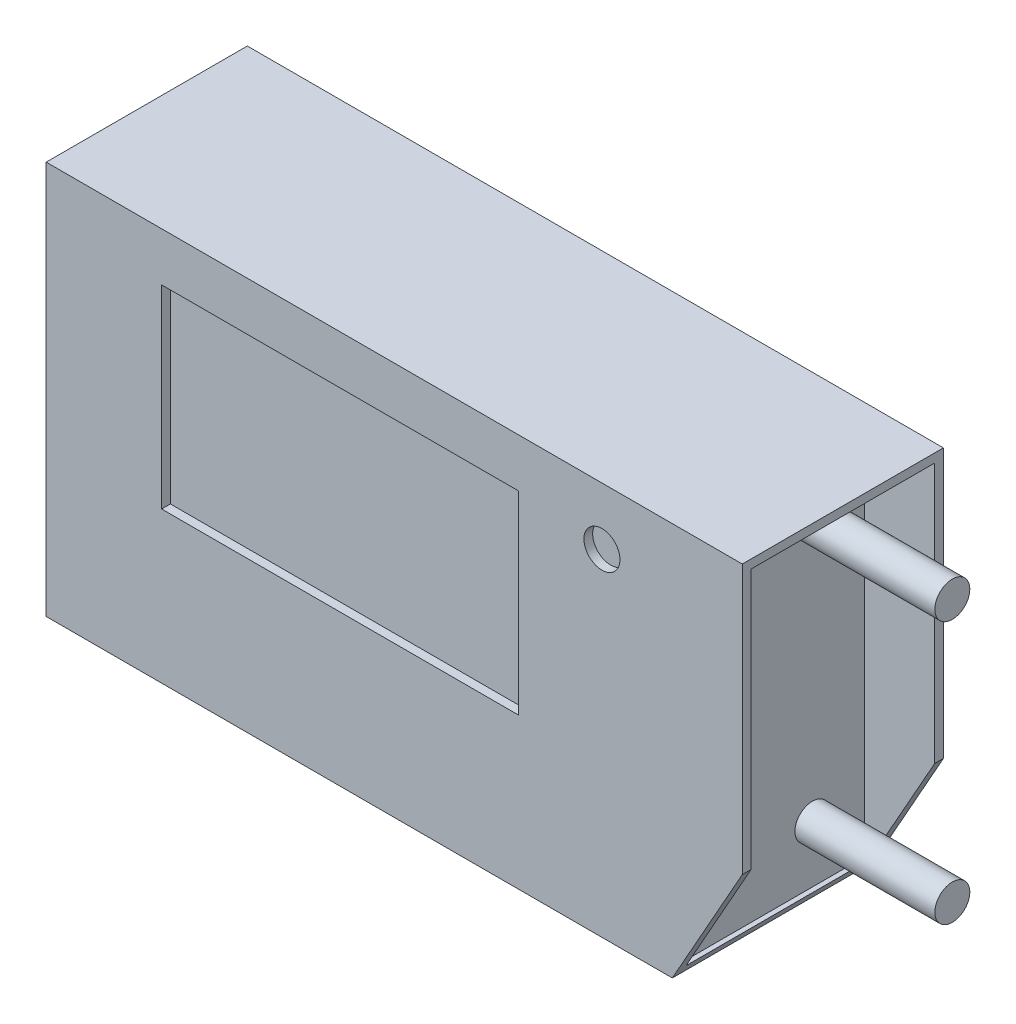
ISO-10303-21;
HEADER;
FILE_DESCRIPTION(('STEP AP214'),'2;1');
FILE_NAME('part.step','',(''),(''),'','','');
FILE_SCHEMA(('AUTOMOTIVE_DESIGN { 1 0 10303 214 1 1 1 1 }'));
ENDSEC;
DATA;
#1=APPLICATION_CONTEXT('core data for automotive mechanical design processes');
#2=APPLICATION_PROTOCOL_DEFINITION('international standard','automotive_design',2000,#1);
#3=PRODUCT_CONTEXT('',#1,'mechanical');
#4=PRODUCT('Part','Part','',(#3));
#5=PRODUCT_RELATED_PRODUCT_CATEGORY('part','',(#4));
#6=PRODUCT_DEFINITION_FORMATION('','',#4);
#7=PRODUCT_DEFINITION_CONTEXT('part definition',#1,'design');
#8=PRODUCT_DEFINITION('design','',#6,#7);
#9=PRODUCT_DEFINITION_SHAPE('','',#8);
#10=(LENGTH_UNIT() NAMED_UNIT(*) SI_UNIT(.MILLI.,.METRE.));
#11=(NAMED_UNIT(*) PLANE_ANGLE_UNIT() SI_UNIT($,.RADIAN.));
#12=(NAMED_UNIT(*) SI_UNIT($,.STERADIAN.) SOLID_ANGLE_UNIT());
#13=UNCERTAINTY_MEASURE_WITH_UNIT(LENGTH_MEASURE(1.E-05),#10,'distance_accuracy_value','');
#14=(GEOMETRIC_REPRESENTATION_CONTEXT(3) GLOBAL_UNCERTAINTY_ASSIGNED_CONTEXT((#13)) GLOBAL_UNIT_ASSIGNED_CONTEXT((#10,
#11,#12)) REPRESENTATION_CONTEXT('',''));
#15=CARTESIAN_POINT('',(0.,0.,0.));
#16=DIRECTION('',(0.,0.,1.));
#17=DIRECTION('',(1.,0.,0.));
#18=AXIS2_PLACEMENT_3D('',#15,#16,#17);
#19=CARTESIAN_POINT('',(-21.,-11.25,5.75));
#20=DIRECTION('',(0.,1.,0.));
#21=DIRECTION('',(-1.,0.,0.));
#22=AXIS2_PLACEMENT_3D('',#19,#20,#21);
#23=PLANE('',#22);
#24=DIRECTION('',(1.,0.,0.));
#25=VECTOR('',#24,1.);
#26=CARTESIAN_POINT('',(-21.,-11.25,5.75));
#27=LINE('',#26,#25);
#28=CARTESIAN_POINT('',(-18.8,-11.25,5.75));
#29=VERTEX_POINT('',#28);
#30=CARTESIAN_POINT('',(17.,-11.25,5.75));
#31=VERTEX_POINT('',#30);
#32=EDGE_CURVE('E307',#29,#31,#27,.T.);
#33=ORIENTED_EDGE('',*,*,#32,.F.);
#34=DIRECTION('',(0.,0.,1.));
#35=VECTOR('',#34,1.);
#36=CARTESIAN_POINT('',(-18.8,-11.25,-5.75));
#37=LINE('',#36,#35);
#38=CARTESIAN_POINT('',(-18.8,-11.25,-5.75));
#39=VERTEX_POINT('',#38);
#40=EDGE_CURVE('E226',#39,#29,#37,.T.);
#41=ORIENTED_EDGE('',*,*,#40,.F.);
#42=DIRECTION('',(1.,0.,0.));
#43=VECTOR('',#42,1.);
#44=CARTESIAN_POINT('',(-21.,-11.25,-5.75));
#45=LINE('',#44,#43);
#46=CARTESIAN_POINT('',(17.,-11.25,-5.75));
#47=VERTEX_POINT('',#46);
#48=EDGE_CURVE('E299',#39,#47,#45,.T.);
#49=ORIENTED_EDGE('',*,*,#48,.T.);
#50=DIRECTION('',(0.,0.,-1.));
#51=VECTOR('',#50,1.);
#52=CARTESIAN_POINT('',(17.,-11.25,5.75));
#53=LINE('',#52,#51);
#54=EDGE_CURVE('E241',#31,#47,#53,.T.);
#55=ORIENTED_EDGE('',*,*,#54,.F.);
#56=EDGE_LOOP('',(#33,#41,#49,#55));
#57=FACE_BOUND('',#56,.T.);
#58=ADVANCED_FACE('F34',(#57),#23,.F.);
#59=CARTESIAN_POINT('',(21.,11.25,5.75));
#60=DIRECTION('',(-1.,0.,0.));
#61=DIRECTION('',(0.,0.,1.));
#62=AXIS2_PLACEMENT_3D('',#59,#60,#61);
#63=PLANE('',#62);
#64=DIRECTION('',(0.,0.,-1.));
#65=VECTOR('',#64,1.);
#66=CARTESIAN_POINT('',(21.,-4.13064990407836,5.75));
#67=LINE('',#66,#65);
#68=CARTESIAN_POINT('',(21.,-4.13064990407836,-5.25));
#69=VERTEX_POINT('',#68);
#70=CARTESIAN_POINT('',(21.,-4.13064990407836,-5.75));
#71=VERTEX_POINT('',#70);
#72=EDGE_CURVE('E246',#69,#71,#67,.T.);
#73=ORIENTED_EDGE('',*,*,#72,.T.);
#74=DIRECTION('',(0.,1.,0.));
#75=VECTOR('',#74,1.);
#76=CARTESIAN_POINT('',(21.,11.25,-5.75));
#77=LINE('',#76,#75);
#78=CARTESIAN_POINT('',(21.,11.25,-5.75));
#79=VERTEX_POINT('',#78);
#80=EDGE_CURVE('E317',#71,#79,#77,.T.);
#81=ORIENTED_EDGE('',*,*,#80,.T.);
#82=DIRECTION('',(0.,0.,-1.));
#83=VECTOR('',#82,1.);
#84=CARTESIAN_POINT('',(21.,11.25,5.75));
#85=LINE('',#84,#83);
#86=CARTESIAN_POINT('',(21.,11.25,5.75));
#87=VERTEX_POINT('',#86);
#88=EDGE_CURVE('E315',#87,#79,#85,.T.);
#89=ORIENTED_EDGE('',*,*,#88,.F.);
#90=DIRECTION('',(0.,1.,0.));
#91=VECTOR('',#90,1.);
#92=CARTESIAN_POINT('',(21.,11.25,5.75));
#93=LINE('',#92,#91);
#94=CARTESIAN_POINT('',(21.,-4.13064990407836,5.75));
#95=VERTEX_POINT('',#94);
#96=EDGE_CURVE('E309',#95,#87,#93,.T.);
#97=ORIENTED_EDGE('',*,*,#96,.F.);
#98=CARTESIAN_POINT('',(21.,-4.13064990407836,5.25));
#99=VERTEX_POINT('',#98);
#100=EDGE_CURVE('E247',#95,#99,#67,.T.);
#101=ORIENTED_EDGE('',*,*,#100,.T.);
#102=DIRECTION('',(0.,-1.,0.));
#103=VECTOR('',#102,1.);
#104=CARTESIAN_POINT('',(21.,10.75,5.25));
#105=LINE('',#104,#103);
#106=CARTESIAN_POINT('',(21.,10.75,5.25));
#107=VERTEX_POINT('',#106);
#108=EDGE_CURVE('E280',#107,#99,#105,.T.);
#109=ORIENTED_EDGE('',*,*,#108,.F.);
#110=DIRECTION('',(0.,0.,1.));
#111=VECTOR('',#110,1.);
#112=CARTESIAN_POINT('',(21.,10.75,-5.25));
#113=LINE('',#112,#111);
#114=CARTESIAN_POINT('',(21.,10.75,-5.25));
#115=VERTEX_POINT('',#114);
#116=EDGE_CURVE('E291',#115,#107,#113,.T.);
#117=ORIENTED_EDGE('',*,*,#116,.F.);
#118=DIRECTION('',(0.,1.,0.));
#119=VECTOR('',#118,1.);
#120=CARTESIAN_POINT('',(21.,-10.75,-5.25));
#121=LINE('',#120,#119);
#122=EDGE_CURVE('E267',#69,#115,#121,.T.);
#123=ORIENTED_EDGE('',*,*,#122,.F.);
#124=EDGE_LOOP('',(#73,#81,#89,#97,#101,#109,#117,#123));
#125=FACE_BOUND('',#124,.T.);
#126=ADVANCED_FACE('F345',(#125),#63,.F.);
#127=CARTESIAN_POINT('',(0.,0.,5.75));
#128=DIRECTION('',(0.,0.,1.));
#129=DIRECTION('',(1.,0.,0.));
#130=AXIS2_PLACEMENT_3D('',#127,#128,#129);
#131=PLANE('',#130);
#132=CARTESIAN_POINT('',(12.9768258929071,7.96460152202627,5.75));
#133=DIRECTION('',(0.,0.,1.));
#134=DIRECTION('',(1.,0.,0.));
#135=AXIS2_PLACEMENT_3D('',#132,#133,#134);
#136=CIRCLE('',#135,1.03063365108844);
#137=CARTESIAN_POINT('',(14.0074595439955,7.96460152202627,5.75));
#138=VERTEX_POINT('',#137);
#139=EDGE_CURVE('E183',#138,#138,#136,.T.);
#140=ORIENTED_EDGE('',*,*,#139,.F.);
#141=EDGE_LOOP('',(#140));
#142=FACE_BOUND('',#141,.T.);
#143=DIRECTION('',(0.,-1.,0.));
#144=VECTOR('',#143,1.);
#145=CARTESIAN_POINT('',(-12.1998328200859,8.47255082345512,5.75));
#146=LINE('',#145,#144);
#147=CARTESIAN_POINT('',(-12.1998328200859,8.47255082345512,5.75));
#148=VERTEX_POINT('',#147);
#149=CARTESIAN_POINT('',(-12.1998328200859,-2.62631762446119,5.75));
#150=VERTEX_POINT('',#149);
#151=EDGE_CURVE('E48',#148,#150,#146,.T.);
#152=ORIENTED_EDGE('',*,*,#151,.F.);
#153=DIRECTION('',(-1.,0.,0.));
#154=VECTOR('',#153,1.);
#155=CARTESIAN_POINT('',(-12.1998328200859,8.47255082345512,5.75));
#156=LINE('',#155,#154);
#157=CARTESIAN_POINT('',(8.19220169162848,8.47255082345512,5.75));
#158=VERTEX_POINT('',#157);
#159=EDGE_CURVE('E177',#158,#148,#156,.T.);
#160=ORIENTED_EDGE('',*,*,#159,.F.);
#161=DIRECTION('',(0.,1.,0.));
#162=VECTOR('',#161,1.);
#163=CARTESIAN_POINT('',(8.19220169162848,8.47255082345512,5.75));
#164=LINE('',#163,#162);
#165=CARTESIAN_POINT('',(8.19220169162849,-2.62631762446119,5.75));
#166=VERTEX_POINT('',#165);
#167=EDGE_CURVE('E180',#166,#158,#164,.T.);
#168=ORIENTED_EDGE('',*,*,#167,.F.);
#169=DIRECTION('',(1.,0.,0.));
#170=VECTOR('',#169,1.);
#171=CARTESIAN_POINT('',(-12.1998328200859,-2.62631762446119,5.75));
#172=LINE('',#171,#170);
#173=EDGE_CURVE('E189',#150,#166,#172,.T.);
#174=ORIENTED_EDGE('',*,*,#173,.F.);
#175=EDGE_LOOP('',(#152,#160,#168,#174));
#176=FACE_BOUND('',#175,.T.);
#177=DIRECTION('',(0.,1.,0.));
#178=VECTOR('',#177,1.);
#179=CARTESIAN_POINT('',(-18.8,11.25,5.75));
#180=LINE('',#179,#178);
#181=CARTESIAN_POINT('',(-18.8,11.25,5.75));
#182=VERTEX_POINT('',#181);
#183=EDGE_CURVE('E56',#29,#182,#180,.T.);
#184=ORIENTED_EDGE('',*,*,#183,.F.);
#185=ORIENTED_EDGE('',*,*,#32,.T.);
#186=DIRECTION('',(-0.489830066040071,-0.871817931911921,0.));
#187=VECTOR('',#186,1.);
#188=CARTESIAN_POINT('',(21.,-4.13064990407836,5.75));
#189=LINE('',#188,#187);
#190=EDGE_CURVE('E238',#95,#31,#189,.T.);
#191=ORIENTED_EDGE('',*,*,#190,.F.);
#192=ORIENTED_EDGE('',*,*,#96,.T.);
#193=DIRECTION('',(-1.,0.,0.));
#194=VECTOR('',#193,1.);
#195=CARTESIAN_POINT('',(-21.,11.25,5.75));
#196=LINE('',#195,#194);
#197=EDGE_CURVE('E312',#87,#182,#196,.T.);
#198=ORIENTED_EDGE('',*,*,#197,.T.);
#199=EDGE_LOOP('',(#184,#185,#191,#192,#198));
#200=FACE_BOUND('',#199,.T.);
#201=ADVANCED_FACE('F350',(#142,#176,#200),#131,.T.);
#202=CARTESIAN_POINT('',(0.,0.,-5.75));
#203=DIRECTION('',(0.,0.,1.));
#204=DIRECTION('',(1.,0.,0.));
#205=AXIS2_PLACEMENT_3D('',#202,#203,#204);
#206=PLANE('',#205);
#207=ORIENTED_EDGE('',*,*,#48,.F.);
#208=DIRECTION('',(0.,1.,0.));
#209=VECTOR('',#208,1.);
#210=CARTESIAN_POINT('',(-18.8,11.25,-5.75));
#211=LINE('',#210,#209);
#212=CARTESIAN_POINT('',(-18.8,11.25,-5.75));
#213=VERTEX_POINT('',#212);
#214=EDGE_CURVE('E223',#39,#213,#211,.T.);
#215=ORIENTED_EDGE('',*,*,#214,.T.);
#216=DIRECTION('',(-1.,0.,0.));
#217=VECTOR('',#216,1.);
#218=CARTESIAN_POINT('',(-21.,11.25,-5.75));
#219=LINE('',#218,#217);
#220=EDGE_CURVE('E310',#79,#213,#219,.T.);
#221=ORIENTED_EDGE('',*,*,#220,.F.);
#222=ORIENTED_EDGE('',*,*,#80,.F.);
#223=DIRECTION('',(-0.489830066040071,-0.871817931911921,0.));
#224=VECTOR('',#223,1.);
#225=CARTESIAN_POINT('',(21.,-4.13064990407836,-5.75));
#226=LINE('',#225,#224);
#227=EDGE_CURVE('E237',#71,#47,#226,.T.);
#228=ORIENTED_EDGE('',*,*,#227,.T.);
#229=EDGE_LOOP('',(#207,#215,#221,#222,#228));
#230=FACE_BOUND('',#229,.T.);
#231=ADVANCED_FACE('F357',(#230),#206,.F.);
#232=CARTESIAN_POINT('',(17.,-10.75,5.25));
#233=DIRECTION('',(0.,-1.,0.));
#234=DIRECTION('',(0.,0.,-1.));
#235=AXIS2_PLACEMENT_3D('',#232,#233,#234);
#236=PLANE('',#235);
#237=DIRECTION('',(0.,0.,1.));
#238=VECTOR('',#237,1.);
#239=CARTESIAN_POINT('',(17.2809245188189,-10.75,5.25));
#240=LINE('',#239,#238);
#241=CARTESIAN_POINT('',(17.2809245188189,-10.75,-5.25));
#242=VERTEX_POINT('',#241);
#243=CARTESIAN_POINT('',(17.2809245188189,-10.75,5.25));
#244=VERTEX_POINT('',#243);
#245=EDGE_CURVE('E250',#242,#244,#240,.T.);
#246=ORIENTED_EDGE('',*,*,#245,.F.);
#247=DIRECTION('',(1.,0.,0.));
#248=VECTOR('',#247,1.);
#249=CARTESIAN_POINT('',(17.,-10.75,-5.25));
#250=LINE('',#249,#248);
#251=CARTESIAN_POINT('',(17.,-10.75,-5.25));
#252=VERTEX_POINT('',#251);
#253=EDGE_CURVE('E289',#252,#242,#250,.T.);
#254=ORIENTED_EDGE('',*,*,#253,.F.);
#255=DIRECTION('',(0.,0.,-1.));
#256=VECTOR('',#255,1.);
#257=CARTESIAN_POINT('',(17.,-10.75,5.25));
#258=LINE('',#257,#256);
#259=CARTESIAN_POINT('',(17.,-10.75,5.25));
#260=VERTEX_POINT('',#259);
#261=EDGE_CURVE('E276',#260,#252,#258,.T.);
#262=ORIENTED_EDGE('',*,*,#261,.F.);
#263=DIRECTION('',(1.,0.,0.));
#264=VECTOR('',#263,1.);
#265=CARTESIAN_POINT('',(17.,-10.75,5.25));
#266=LINE('',#265,#264);
#267=EDGE_CURVE('E296',#260,#244,#266,.T.);
#268=ORIENTED_EDGE('',*,*,#267,.T.);
#269=EDGE_LOOP('',(#246,#254,#262,#268));
#270=FACE_BOUND('',#269,.T.);
#271=ADVANCED_FACE('F331',(#270),#236,.F.);
#272=CARTESIAN_POINT('',(17.,10.75,5.25));
#273=DIRECTION('',(0.,0.,1.));
#274=DIRECTION('',(1.,0.,0.));
#275=AXIS2_PLACEMENT_3D('',#272,#273,#274);
#276=PLANE('',#275);
#277=DIRECTION('',(0.489830066040071,0.871817931911921,0.));
#278=VECTOR('',#277,1.);
#279=CARTESIAN_POINT('',(26.3949379735934,5.47146314086994,5.25));
#280=LINE('',#279,#278);
#281=EDGE_CURVE('E252',#244,#99,#280,.T.);
#282=ORIENTED_EDGE('',*,*,#281,.F.);
#283=ORIENTED_EDGE('',*,*,#267,.F.);
#284=DIRECTION('',(0.,-1.,0.));
#285=VECTOR('',#284,1.);
#286=CARTESIAN_POINT('',(17.,10.75,5.25));
#287=LINE('',#286,#285);
#288=CARTESIAN_POINT('',(17.,10.75,5.25));
#289=VERTEX_POINT('',#288);
#290=EDGE_CURVE('E286',#289,#260,#287,.T.);
#291=ORIENTED_EDGE('',*,*,#290,.F.);
#292=DIRECTION('',(1.,0.,0.));
#293=VECTOR('',#292,1.);
#294=CARTESIAN_POINT('',(17.,10.75,5.25));
#295=LINE('',#294,#293);
#296=EDGE_CURVE('E300',#289,#107,#295,.T.);
#297=ORIENTED_EDGE('',*,*,#296,.T.);
#298=ORIENTED_EDGE('',*,*,#108,.T.);
#299=EDGE_LOOP('',(#282,#283,#291,#297,#298));
#300=FACE_BOUND('',#299,.T.);
#301=ADVANCED_FACE('F340',(#300),#276,.F.);
#302=CARTESIAN_POINT('',(17.,-10.75,-5.25));
#303=DIRECTION('',(0.,0.,-1.));
#304=DIRECTION('',(-1.,0.,0.));
#305=AXIS2_PLACEMENT_3D('',#302,#303,#304);
#306=PLANE('',#305);
#307=DIRECTION('',(-0.489830066040071,-0.871817931911921,0.));
#308=VECTOR('',#307,1.);
#309=CARTESIAN_POINT('',(17.2135213175817,-10.8699667467984,-5.25));
#310=LINE('',#309,#308);
#311=EDGE_CURVE('E41',#69,#242,#310,.T.);
#312=ORIENTED_EDGE('',*,*,#311,.F.);
#313=ORIENTED_EDGE('',*,*,#122,.T.);
#314=DIRECTION('',(1.,0.,0.));
#315=VECTOR('',#314,1.);
#316=CARTESIAN_POINT('',(17.,10.75,-5.25));
#317=LINE('',#316,#315);
#318=CARTESIAN_POINT('',(17.,10.75,-5.25));
#319=VERTEX_POINT('',#318);
#320=EDGE_CURVE('E302',#319,#115,#317,.T.);
#321=ORIENTED_EDGE('',*,*,#320,.F.);
#322=DIRECTION('',(0.,1.,0.));
#323=VECTOR('',#322,1.);
#324=CARTESIAN_POINT('',(17.,-10.75,-5.25));
#325=LINE('',#324,#323);
#326=EDGE_CURVE('E279',#252,#319,#325,.T.);
#327=ORIENTED_EDGE('',*,*,#326,.F.);
#328=ORIENTED_EDGE('',*,*,#253,.T.);
#329=EDGE_LOOP('',(#312,#313,#321,#327,#328));
#330=FACE_BOUND('',#329,.T.);
#331=ADVANCED_FACE('F334',(#330),#306,.F.);
#332=CARTESIAN_POINT('',(-21.,11.25,5.75));
#333=DIRECTION('',(0.,-1.,0.));
#334=DIRECTION('',(0.,0.,-1.));
#335=AXIS2_PLACEMENT_3D('',#332,#333,#334);
#336=PLANE('',#335);
#337=ORIENTED_EDGE('',*,*,#220,.T.);
#338=DIRECTION('',(0.,0.,1.));
#339=VECTOR('',#338,1.);
#340=CARTESIAN_POINT('',(-18.8,11.25,-5.75));
#341=LINE('',#340,#339);
#342=EDGE_CURVE('E228',#213,#182,#341,.T.);
#343=ORIENTED_EDGE('',*,*,#342,.T.);
#344=ORIENTED_EDGE('',*,*,#197,.F.);
#345=ORIENTED_EDGE('',*,*,#88,.T.);
#346=EDGE_LOOP('',(#337,#343,#344,#345));
#347=FACE_BOUND('',#346,.T.);
#348=ADVANCED_FACE('F363',(#347),#336,.F.);
#349=CARTESIAN_POINT('',(17.,10.75,-5.25));
#350=DIRECTION('',(0.,1.,0.));
#351=DIRECTION('',(0.,0.,1.));
#352=AXIS2_PLACEMENT_3D('',#349,#350,#351);
#353=PLANE('',#352);
#354=ORIENTED_EDGE('',*,*,#116,.T.);
#355=ORIENTED_EDGE('',*,*,#296,.F.);
#356=DIRECTION('',(0.,0.,1.));
#357=VECTOR('',#356,1.);
#358=CARTESIAN_POINT('',(17.,10.75,-5.25));
#359=LINE('',#358,#357);
#360=EDGE_CURVE('E283',#319,#289,#359,.T.);
#361=ORIENTED_EDGE('',*,*,#360,.F.);
#362=ORIENTED_EDGE('',*,*,#320,.T.);
#363=EDGE_LOOP('',(#354,#355,#361,#362));
#364=FACE_BOUND('',#363,.T.);
#365=ADVANCED_FACE('F361',(#364),#353,.F.);
#366=CARTESIAN_POINT('',(17.,0.,0.));
#367=DIRECTION('',(1.,0.,0.));
#368=DIRECTION('',(0.,0.,-1.));
#369=AXIS2_PLACEMENT_3D('',#366,#367,#368);
#370=PLANE('',#369);
#371=CARTESIAN_POINT('',(17.,-7.5,-2.2599444652056));
#372=DIRECTION('',(1.,0.,0.));
#373=DIRECTION('',(0.,0.,1.));
#374=AXIS2_PLACEMENT_3D('',#371,#372,#373);
#375=CIRCLE('',#374,1.);
#376=CARTESIAN_POINT('',(17.,-7.5,-1.2599444652056));
#377=VERTEX_POINT('',#376);
#378=EDGE_CURVE('E209',#377,#377,#375,.T.);
#379=ORIENTED_EDGE('',*,*,#378,.F.);
#380=EDGE_LOOP('',(#379));
#381=FACE_BOUND('',#380,.T.);
#382=CARTESIAN_POINT('',(17.,7.5,-2.2599444652056));
#383=DIRECTION('',(1.,0.,0.));
#384=DIRECTION('',(0.,0.,-1.));
#385=AXIS2_PLACEMENT_3D('',#382,#383,#384);
#386=CIRCLE('',#385,1.);
#387=CARTESIAN_POINT('',(17.,7.5,-3.2599444652056));
#388=VERTEX_POINT('',#387);
#389=EDGE_CURVE('E215',#388,#388,#386,.T.);
#390=ORIENTED_EDGE('',*,*,#389,.F.);
#391=EDGE_LOOP('',(#390));
#392=FACE_BOUND('',#391,.T.);
#393=ORIENTED_EDGE('',*,*,#261,.T.);
#394=ORIENTED_EDGE('',*,*,#326,.T.);
#395=ORIENTED_EDGE('',*,*,#360,.T.);
#396=ORIENTED_EDGE('',*,*,#290,.T.);
#397=EDGE_LOOP('',(#393,#394,#395,#396));
#398=FACE_BOUND('',#397,.T.);
#399=ADVANCED_FACE('F337',(#381,#392,#398),#370,.T.);
#400=CARTESIAN_POINT('',(21.,-4.13064990407836,5.75));
#401=DIRECTION('',(0.871817931911921,-0.489830066040071,0.));
#402=DIRECTION('',(0.489830066040071,0.871817931911921,0.));
#403=AXIS2_PLACEMENT_3D('',#400,#401,#402);
#404=PLANE('',#403);
#405=ORIENTED_EDGE('',*,*,#281,.T.);
#406=ORIENTED_EDGE('',*,*,#100,.F.);
#407=ORIENTED_EDGE('',*,*,#190,.T.);
#408=ORIENTED_EDGE('',*,*,#54,.T.);
#409=ORIENTED_EDGE('',*,*,#227,.F.);
#410=ORIENTED_EDGE('',*,*,#72,.F.);
#411=ORIENTED_EDGE('',*,*,#311,.T.);
#412=ORIENTED_EDGE('',*,*,#245,.T.);
#413=EDGE_LOOP('',(#405,#406,#407,#408,#409,#410,#411,#412));
#414=FACE_BOUND('',#413,.T.);
#415=ADVANCED_FACE('F325',(#414),#404,.T.);
#416=CARTESIAN_POINT('',(-18.8,11.25,-5.75));
#417=DIRECTION('',(1.,0.,0.));
#418=DIRECTION('',(0.,1.,0.));
#419=AXIS2_PLACEMENT_3D('',#416,#417,#418);
#420=PLANE('',#419);
#421=DIRECTION('',(0.,0.,-1.));
#422=VECTOR('',#421,1.);
#423=CARTESIAN_POINT('',(-18.8,-10.75,5.25));
#424=LINE('',#423,#422);
#425=CARTESIAN_POINT('',(-18.8,-10.75,5.25));
#426=VERTEX_POINT('',#425);
#427=CARTESIAN_POINT('',(-18.8,-10.75,-5.25));
#428=VERTEX_POINT('',#427);
#429=EDGE_CURVE('E235',#426,#428,#424,.T.);
#430=ORIENTED_EDGE('',*,*,#429,.T.);
#431=DIRECTION('',(0.,1.,0.));
#432=VECTOR('',#431,1.);
#433=CARTESIAN_POINT('',(-18.8,-10.75,-5.25));
#434=LINE('',#433,#432);
#435=CARTESIAN_POINT('',(-18.8,10.75,-5.25));
#436=VERTEX_POINT('',#435);
#437=EDGE_CURVE('E233',#428,#436,#434,.T.);
#438=ORIENTED_EDGE('',*,*,#437,.T.);
#439=DIRECTION('',(0.,0.,1.));
#440=VECTOR('',#439,1.);
#441=CARTESIAN_POINT('',(-18.8,10.75,-5.25));
#442=LINE('',#441,#440);
#443=CARTESIAN_POINT('',(-18.8,10.75,5.25));
#444=VERTEX_POINT('',#443);
#445=EDGE_CURVE('E230',#436,#444,#442,.T.);
#446=ORIENTED_EDGE('',*,*,#445,.T.);
#447=DIRECTION('',(0.,-1.,0.));
#448=VECTOR('',#447,1.);
#449=CARTESIAN_POINT('',(-18.8,10.75,5.25));
#450=LINE('',#449,#448);
#451=EDGE_CURVE('E11',#444,#426,#450,.T.);
#452=ORIENTED_EDGE('',*,*,#451,.T.);
#453=EDGE_LOOP('',(#430,#438,#446,#452));
#454=FACE_BOUND('',#453,.T.);
#455=ORIENTED_EDGE('',*,*,#183,.T.);
#456=ORIENTED_EDGE('',*,*,#342,.F.);
#457=ORIENTED_EDGE('',*,*,#214,.F.);
#458=ORIENTED_EDGE('',*,*,#40,.T.);
#459=EDGE_LOOP('',(#455,#456,#457,#458));
#460=FACE_BOUND('',#459,.T.);
#461=ADVANCED_FACE('F415',(#454,#460),#420,.F.);
#462=CARTESIAN_POINT('',(-17.,0.,0.));
#463=DIRECTION('',(-1.,0.,0.));
#464=DIRECTION('',(0.,0.,-1.));
#465=AXIS2_PLACEMENT_3D('',#462,#463,#464);
#466=PLANE('',#465);
#467=CARTESIAN_POINT('',(-17.,-2.9881487928831,-3.36480620375057));
#468=DIRECTION('',(-1.,0.,0.));
#469=DIRECTION('',(0.,0.,-1.));
#470=AXIS2_PLACEMENT_3D('',#467,#468,#469);
#471=CIRCLE('',#470,0.5);
#472=CARTESIAN_POINT('',(-17.,-2.9881487928831,-3.86480620375057));
#473=VERTEX_POINT('',#472);
#474=EDGE_CURVE('E196',#473,#473,#471,.T.);
#475=ORIENTED_EDGE('',*,*,#474,.F.);
#476=EDGE_LOOP('',(#475));
#477=FACE_BOUND('',#476,.T.);
#478=CARTESIAN_POINT('',(-17.,2.9881487928831,-3.36480620375057));
#479=DIRECTION('',(-1.,0.,0.));
#480=DIRECTION('',(0.,0.,1.));
#481=AXIS2_PLACEMENT_3D('',#478,#479,#480);
#482=CIRCLE('',#481,0.5);
#483=CARTESIAN_POINT('',(-17.,2.9881487928831,-2.86480620375057));
#484=VERTEX_POINT('',#483);
#485=EDGE_CURVE('E203',#484,#484,#482,.T.);
#486=ORIENTED_EDGE('',*,*,#485,.F.);
#487=EDGE_LOOP('',(#486));
#488=FACE_BOUND('',#487,.T.);
#489=DIRECTION('',(0.,0.,-1.));
#490=VECTOR('',#489,1.);
#491=CARTESIAN_POINT('',(-17.,-10.75,5.25));
#492=LINE('',#491,#490);
#493=CARTESIAN_POINT('',(-17.,-10.75,5.25));
#494=VERTEX_POINT('',#493);
#495=CARTESIAN_POINT('',(-17.,-10.75,-5.25));
#496=VERTEX_POINT('',#495);
#497=EDGE_CURVE('E254',#494,#496,#492,.T.);
#498=ORIENTED_EDGE('',*,*,#497,.F.);
#499=DIRECTION('',(0.,-1.,0.));
#500=VECTOR('',#499,1.);
#501=CARTESIAN_POINT('',(-17.,10.75,5.25));
#502=LINE('',#501,#500);
#503=CARTESIAN_POINT('',(-17.,10.75,5.25));
#504=VERTEX_POINT('',#503);
#505=EDGE_CURVE('E257',#504,#494,#502,.T.);
#506=ORIENTED_EDGE('',*,*,#505,.F.);
#507=DIRECTION('',(0.,0.,1.));
#508=VECTOR('',#507,1.);
#509=CARTESIAN_POINT('',(-17.,10.75,-5.25));
#510=LINE('',#509,#508);
#511=CARTESIAN_POINT('',(-17.,10.75,-5.25));
#512=VERTEX_POINT('',#511);
#513=EDGE_CURVE('E259',#512,#504,#510,.T.);
#514=ORIENTED_EDGE('',*,*,#513,.F.);
#515=DIRECTION('',(0.,1.,0.));
#516=VECTOR('',#515,1.);
#517=CARTESIAN_POINT('',(-17.,-10.75,-5.25));
#518=LINE('',#517,#516);
#519=EDGE_CURVE('E261',#496,#512,#518,.T.);
#520=ORIENTED_EDGE('',*,*,#519,.F.);
#521=EDGE_LOOP('',(#498,#506,#514,#520));
#522=FACE_BOUND('',#521,.T.);
#523=ADVANCED_FACE('F405',(#477,#488,#522),#466,.T.);
#524=CARTESIAN_POINT('',(-17.,10.75,5.25));
#525=DIRECTION('',(0.,0.,-1.));
#526=DIRECTION('',(-1.,0.,0.));
#527=AXIS2_PLACEMENT_3D('',#524,#525,#526);
#528=PLANE('',#527);
#529=ORIENTED_EDGE('',*,*,#451,.F.);
#530=DIRECTION('',(-1.,0.,0.));
#531=VECTOR('',#530,1.);
#532=CARTESIAN_POINT('',(-17.,10.75,5.25));
#533=LINE('',#532,#531);
#534=EDGE_CURVE('E271',#504,#444,#533,.T.);
#535=ORIENTED_EDGE('',*,*,#534,.F.);
#536=ORIENTED_EDGE('',*,*,#505,.T.);
#537=DIRECTION('',(-1.,0.,0.));
#538=VECTOR('',#537,1.);
#539=CARTESIAN_POINT('',(-17.,-10.75,5.25));
#540=LINE('',#539,#538);
#541=EDGE_CURVE('E263',#494,#426,#540,.T.);
#542=ORIENTED_EDGE('',*,*,#541,.T.);
#543=EDGE_LOOP('',(#529,#535,#536,#542));
#544=FACE_BOUND('',#543,.T.);
#545=ADVANCED_FACE('F401',(#544),#528,.T.);
#546=CARTESIAN_POINT('',(-17.,10.75,-5.25));
#547=DIRECTION('',(0.,-1.,0.));
#548=DIRECTION('',(0.,0.,-1.));
#549=AXIS2_PLACEMENT_3D('',#546,#547,#548);
#550=PLANE('',#549);
#551=ORIENTED_EDGE('',*,*,#445,.F.);
#552=DIRECTION('',(-1.,0.,0.));
#553=VECTOR('',#552,1.);
#554=CARTESIAN_POINT('',(-17.,10.75,-5.25));
#555=LINE('',#554,#553);
#556=EDGE_CURVE('E268',#512,#436,#555,.T.);
#557=ORIENTED_EDGE('',*,*,#556,.F.);
#558=ORIENTED_EDGE('',*,*,#513,.T.);
#559=ORIENTED_EDGE('',*,*,#534,.T.);
#560=EDGE_LOOP('',(#551,#557,#558,#559));
#561=FACE_BOUND('',#560,.T.);
#562=ADVANCED_FACE('F404',(#561),#550,.T.);
#563=CARTESIAN_POINT('',(-17.,-10.75,-5.25));
#564=DIRECTION('',(0.,0.,1.));
#565=DIRECTION('',(1.,0.,0.));
#566=AXIS2_PLACEMENT_3D('',#563,#564,#565);
#567=PLANE('',#566);
#568=ORIENTED_EDGE('',*,*,#437,.F.);
#569=DIRECTION('',(-1.,0.,0.));
#570=VECTOR('',#569,1.);
#571=CARTESIAN_POINT('',(-17.,-10.75,-5.25));
#572=LINE('',#571,#570);
#573=EDGE_CURVE('E264',#496,#428,#572,.T.);
#574=ORIENTED_EDGE('',*,*,#573,.F.);
#575=ORIENTED_EDGE('',*,*,#519,.T.);
#576=ORIENTED_EDGE('',*,*,#556,.T.);
#577=EDGE_LOOP('',(#568,#574,#575,#576));
#578=FACE_BOUND('',#577,.T.);
#579=ADVANCED_FACE('F399',(#578),#567,.T.);
#580=CARTESIAN_POINT('',(-17.,-10.75,5.25));
#581=DIRECTION('',(0.,1.,0.));
#582=DIRECTION('',(0.,0.,1.));
#583=AXIS2_PLACEMENT_3D('',#580,#581,#582);
#584=PLANE('',#583);
#585=ORIENTED_EDGE('',*,*,#429,.F.);
#586=ORIENTED_EDGE('',*,*,#541,.F.);
#587=ORIENTED_EDGE('',*,*,#497,.T.);
#588=ORIENTED_EDGE('',*,*,#573,.T.);
#589=EDGE_LOOP('',(#585,#586,#587,#588));
#590=FACE_BOUND('',#589,.T.);
#591=ADVANCED_FACE('F395',(#590),#584,.T.);
#592=CARTESIAN_POINT('',(25.,7.5,-2.2599444652056));
#593=DIRECTION('',(-1.,0.,0.));
#594=DIRECTION('',(0.,0.,1.));
#595=AXIS2_PLACEMENT_3D('',#592,#593,#594);
#596=CYLINDRICAL_SURFACE('',#595,1.);
#597=CARTESIAN_POINT('',(25.,7.5,-2.2599444652056));
#598=DIRECTION('',(1.,0.,0.));
#599=DIRECTION('',(0.,0.,-1.));
#600=AXIS2_PLACEMENT_3D('',#597,#598,#599);
#601=CIRCLE('',#600,1.);
#602=CARTESIAN_POINT('',(25.,7.5,-3.2599444652056));
#603=VERTEX_POINT('',#602);
#604=EDGE_CURVE('E218',#603,#603,#601,.T.);
#605=ORIENTED_EDGE('',*,*,#604,.F.);
#606=EDGE_LOOP('',(#605));
#607=FACE_BOUND('',#606,.T.);
#608=ORIENTED_EDGE('',*,*,#389,.T.);
#609=EDGE_LOOP('',(#608));
#610=FACE_BOUND('',#609,.T.);
#611=ADVANCED_FACE('F398',(#607,#610),#596,.T.);
#612=CARTESIAN_POINT('',(25.,7.5,-2.2599444652056));
#613=DIRECTION('',(1.,0.,0.));
#614=DIRECTION('',(0.,0.,-1.));
#615=AXIS2_PLACEMENT_3D('',#612,#613,#614);
#616=PLANE('',#615);
#617=ORIENTED_EDGE('',*,*,#604,.T.);
#618=EDGE_LOOP('',(#617));
#619=FACE_BOUND('',#618,.T.);
#620=ADVANCED_FACE('F424',(#619),#616,.T.);
#621=CARTESIAN_POINT('',(25.,-7.5,-2.2599444652056));
#622=DIRECTION('',(-1.,0.,0.));
#623=DIRECTION('',(0.,0.,1.));
#624=AXIS2_PLACEMENT_3D('',#621,#622,#623);
#625=CYLINDRICAL_SURFACE('',#624,1.);
#626=CARTESIAN_POINT('',(25.,-7.5,-2.2599444652056));
#627=DIRECTION('',(1.,0.,0.));
#628=DIRECTION('',(0.,0.,1.));
#629=AXIS2_PLACEMENT_3D('',#626,#627,#628);
#630=CIRCLE('',#629,1.);
#631=CARTESIAN_POINT('',(25.,-7.5,-1.2599444652056));
#632=VERTEX_POINT('',#631);
#633=EDGE_CURVE('E212',#632,#632,#630,.T.);
#634=ORIENTED_EDGE('',*,*,#633,.F.);
#635=EDGE_LOOP('',(#634));
#636=FACE_BOUND('',#635,.T.);
#637=ORIENTED_EDGE('',*,*,#378,.T.);
#638=EDGE_LOOP('',(#637));
#639=FACE_BOUND('',#638,.T.);
#640=ADVANCED_FACE('F428',(#636,#639),#625,.T.);
#641=CARTESIAN_POINT('',(25.,-7.5,-2.2599444652056));
#642=DIRECTION('',(-1.,0.,0.));
#643=DIRECTION('',(0.,0.,1.));
#644=AXIS2_PLACEMENT_3D('',#641,#642,#643);
#645=PLANE('',#644);
#646=ORIENTED_EDGE('',*,*,#633,.T.);
#647=EDGE_LOOP('',(#646));
#648=FACE_BOUND('',#647,.T.);
#649=ADVANCED_FACE('F432',(#648),#645,.F.);
#650=CARTESIAN_POINT('',(-25.,2.9881487928831,-3.36480620375057));
#651=DIRECTION('',(1.,0.,0.));
#652=DIRECTION('',(0.,0.,-1.));
#653=AXIS2_PLACEMENT_3D('',#650,#651,#652);
#654=CYLINDRICAL_SURFACE('',#653,0.5);
#655=CARTESIAN_POINT('',(-25.,2.9881487928831,-3.36480620375057));
#656=DIRECTION('',(-1.,0.,0.));
#657=DIRECTION('',(0.,0.,1.));
#658=AXIS2_PLACEMENT_3D('',#655,#656,#657);
#659=CIRCLE('',#658,0.5);
#660=CARTESIAN_POINT('',(-25.,2.9881487928831,-2.86480620375057));
#661=VERTEX_POINT('',#660);
#662=EDGE_CURVE('E206',#661,#661,#659,.T.);
#663=ORIENTED_EDGE('',*,*,#662,.F.);
#664=EDGE_LOOP('',(#663));
#665=FACE_BOUND('',#664,.T.);
#666=ORIENTED_EDGE('',*,*,#485,.T.);
#667=EDGE_LOOP('',(#666));
#668=FACE_BOUND('',#667,.T.);
#669=ADVANCED_FACE('F436',(#665,#668),#654,.T.);
#670=CARTESIAN_POINT('',(-25.,2.9881487928831,-3.36480620375057));
#671=DIRECTION('',(-1.,0.,0.));
#672=DIRECTION('',(0.,0.,1.));
#673=AXIS2_PLACEMENT_3D('',#670,#671,#672);
#674=PLANE('',#673);
#675=ORIENTED_EDGE('',*,*,#662,.T.);
#676=EDGE_LOOP('',(#675));
#677=FACE_BOUND('',#676,.T.);
#678=ADVANCED_FACE('F440',(#677),#674,.T.);
#679=CARTESIAN_POINT('',(-25.,-2.9881487928831,-3.36480620375057));
#680=DIRECTION('',(1.,0.,0.));
#681=DIRECTION('',(0.,0.,-1.));
#682=AXIS2_PLACEMENT_3D('',#679,#680,#681);
#683=CYLINDRICAL_SURFACE('',#682,0.5);
#684=CARTESIAN_POINT('',(-25.,-2.9881487928831,-3.36480620375057));
#685=DIRECTION('',(-1.,0.,0.));
#686=DIRECTION('',(0.,0.,-1.));
#687=AXIS2_PLACEMENT_3D('',#684,#685,#686);
#688=CIRCLE('',#687,0.5);
#689=CARTESIAN_POINT('',(-25.,-2.9881487928831,-3.86480620375057));
#690=VERTEX_POINT('',#689);
#691=EDGE_CURVE('E200',#690,#690,#688,.T.);
#692=ORIENTED_EDGE('',*,*,#691,.F.);
#693=EDGE_LOOP('',(#692));
#694=FACE_BOUND('',#693,.T.);
#695=ORIENTED_EDGE('',*,*,#474,.T.);
#696=EDGE_LOOP('',(#695));
#697=FACE_BOUND('',#696,.T.);
#698=ADVANCED_FACE('F444',(#694,#697),#683,.T.);
#699=CARTESIAN_POINT('',(-25.,-2.9881487928831,-3.36480620375057));
#700=DIRECTION('',(1.,0.,0.));
#701=DIRECTION('',(0.,0.,-1.));
#702=AXIS2_PLACEMENT_3D('',#699,#700,#701);
#703=PLANE('',#702);
#704=ORIENTED_EDGE('',*,*,#691,.T.);
#705=EDGE_LOOP('',(#704));
#706=FACE_BOUND('',#705,.T.);
#707=ADVANCED_FACE('F448',(#706),#703,.F.);
#708=CARTESIAN_POINT('',(-12.1998328200859,8.47255082345512,5.25));
#709=DIRECTION('',(-1.,0.,0.));
#710=DIRECTION('',(0.,0.,1.));
#711=AXIS2_PLACEMENT_3D('',#708,#709,#710);
#712=PLANE('',#711);
#713=ORIENTED_EDGE('',*,*,#151,.T.);
#714=DIRECTION('',(0.,0.,1.));
#715=VECTOR('',#714,1.);
#716=CARTESIAN_POINT('',(-12.1998328200859,-2.62631762446119,5.25));
#717=LINE('',#716,#715);
#718=CARTESIAN_POINT('',(-12.1998328200859,-2.62631762446119,5.25));
#719=VERTEX_POINT('',#718);
#720=EDGE_CURVE('E155',#719,#150,#717,.T.);
#721=ORIENTED_EDGE('',*,*,#720,.F.);
#722=DIRECTION('',(0.,-1.,0.));
#723=VECTOR('',#722,1.);
#724=CARTESIAN_POINT('',(-12.1998328200859,8.47255082345512,5.25));
#725=LINE('',#724,#723);
#726=CARTESIAN_POINT('',(-12.1998328200859,8.47255082345512,5.25));
#727=VERTEX_POINT('',#726);
#728=EDGE_CURVE('E159',#727,#719,#725,.T.);
#729=ORIENTED_EDGE('',*,*,#728,.F.);
#730=DIRECTION('',(0.,0.,1.));
#731=VECTOR('',#730,1.);
#732=CARTESIAN_POINT('',(-12.1998328200859,8.47255082345512,5.25));
#733=LINE('',#732,#731);
#734=EDGE_CURVE('E194',#727,#148,#733,.T.);
#735=ORIENTED_EDGE('',*,*,#734,.T.);
#736=EDGE_LOOP('',(#713,#721,#729,#735));
#737=FACE_BOUND('',#736,.T.);
#738=ADVANCED_FACE('F157',(#737),#712,.F.);
#739=CARTESIAN_POINT('',(-12.1998328200859,8.47255082345512,5.25));
#740=DIRECTION('',(0.,1.,0.));
#741=DIRECTION('',(0.,0.,1.));
#742=AXIS2_PLACEMENT_3D('',#739,#740,#741);
#743=PLANE('',#742);
#744=ORIENTED_EDGE('',*,*,#159,.T.);
#745=ORIENTED_EDGE('',*,*,#734,.F.);
#746=DIRECTION('',(-1.,0.,0.));
#747=VECTOR('',#746,1.);
#748=CARTESIAN_POINT('',(-12.1998328200859,8.47255082345512,5.25));
#749=LINE('',#748,#747);
#750=CARTESIAN_POINT('',(8.19220169162848,8.47255082345512,5.25));
#751=VERTEX_POINT('',#750);
#752=EDGE_CURVE('E165',#751,#727,#749,.T.);
#753=ORIENTED_EDGE('',*,*,#752,.F.);
#754=DIRECTION('',(0.,0.,1.));
#755=VECTOR('',#754,1.);
#756=CARTESIAN_POINT('',(8.19220169162848,8.47255082345512,5.25));
#757=LINE('',#756,#755);
#758=EDGE_CURVE('E197',#751,#158,#757,.T.);
#759=ORIENTED_EDGE('',*,*,#758,.T.);
#760=EDGE_LOOP('',(#744,#745,#753,#759));
#761=FACE_BOUND('',#760,.T.);
#762=ADVANCED_FACE('F455',(#761),#743,.F.);
#763=CARTESIAN_POINT('',(8.19220169162848,8.47255082345512,5.25));
#764=DIRECTION('',(1.,0.,0.));
#765=DIRECTION('',(0.,1.,0.));
#766=AXIS2_PLACEMENT_3D('',#763,#764,#765);
#767=PLANE('',#766);
#768=ORIENTED_EDGE('',*,*,#167,.T.);
#769=ORIENTED_EDGE('',*,*,#758,.F.);
#770=DIRECTION('',(0.,1.,0.));
#771=VECTOR('',#770,1.);
#772=CARTESIAN_POINT('',(8.19220169162848,8.47255082345512,5.25));
#773=LINE('',#772,#771);
#774=CARTESIAN_POINT('',(8.19220169162849,-2.62631762446119,5.25));
#775=VERTEX_POINT('',#774);
#776=EDGE_CURVE('E173',#775,#751,#773,.T.);
#777=ORIENTED_EDGE('',*,*,#776,.F.);
#778=DIRECTION('',(0.,0.,1.));
#779=VECTOR('',#778,1.);
#780=CARTESIAN_POINT('',(8.19220169162849,-2.62631762446119,5.25));
#781=LINE('',#780,#779);
#782=EDGE_CURVE('E164',#775,#166,#781,.T.);
#783=ORIENTED_EDGE('',*,*,#782,.T.);
#784=EDGE_LOOP('',(#768,#769,#777,#783));
#785=FACE_BOUND('',#784,.T.);
#786=ADVANCED_FACE('F458',(#785),#767,.F.);
#787=CARTESIAN_POINT('',(-12.1998328200859,-2.62631762446119,5.25));
#788=DIRECTION('',(0.,-1.,0.));
#789=DIRECTION('',(0.,0.,-1.));
#790=AXIS2_PLACEMENT_3D('',#787,#788,#789);
#791=PLANE('',#790);
#792=ORIENTED_EDGE('',*,*,#173,.T.);
#793=ORIENTED_EDGE('',*,*,#782,.F.);
#794=DIRECTION('',(1.,0.,0.));
#795=VECTOR('',#794,1.);
#796=CARTESIAN_POINT('',(-12.1998328200859,-2.62631762446119,5.25));
#797=LINE('',#796,#795);
#798=EDGE_CURVE('E168',#719,#775,#797,.T.);
#799=ORIENTED_EDGE('',*,*,#798,.F.);
#800=ORIENTED_EDGE('',*,*,#720,.T.);
#801=EDGE_LOOP('',(#792,#793,#799,#800));
#802=FACE_BOUND('',#801,.T.);
#803=ADVANCED_FACE('F169',(#802),#791,.F.);
#804=CARTESIAN_POINT('',(0.,0.,5.25));
#805=DIRECTION('',(0.,0.,1.));
#806=DIRECTION('',(1.,0.,0.));
#807=AXIS2_PLACEMENT_3D('',#804,#805,#806);
#808=PLANE('',#807);
#809=ORIENTED_EDGE('',*,*,#728,.T.);
#810=ORIENTED_EDGE('',*,*,#798,.T.);
#811=ORIENTED_EDGE('',*,*,#776,.T.);
#812=ORIENTED_EDGE('',*,*,#752,.T.);
#813=EDGE_LOOP('',(#809,#810,#811,#812));
#814=FACE_BOUND('',#813,.T.);
#815=ADVANCED_FACE('F175',(#814),#808,.T.);
#816=CARTESIAN_POINT('',(12.9768258929071,7.96460152202627,5.25));
#817=DIRECTION('',(0.,0.,1.));
#818=DIRECTION('',(1.,0.,0.));
#819=AXIS2_PLACEMENT_3D('',#816,#817,#818);
#820=CYLINDRICAL_SURFACE('',#819,1.03063365108844);
#821=CARTESIAN_POINT('',(12.9768258929071,7.96460152202627,5.25));
#822=DIRECTION('',(0.,0.,1.));
#823=DIRECTION('',(1.,0.,0.));
#824=AXIS2_PLACEMENT_3D('',#821,#822,#823);
#825=CIRCLE('',#824,1.03063365108844);
#826=CARTESIAN_POINT('',(14.0074595439955,7.96460152202627,5.25));
#827=VERTEX_POINT('',#826);
#828=EDGE_CURVE('E190',#827,#827,#825,.T.);
#829=ORIENTED_EDGE('',*,*,#828,.F.);
#830=EDGE_LOOP('',(#829));
#831=FACE_BOUND('',#830,.T.);
#832=ORIENTED_EDGE('',*,*,#139,.T.);
#833=EDGE_LOOP('',(#832));
#834=FACE_BOUND('',#833,.T.);
#835=ADVANCED_FACE('F467',(#831,#834),#820,.F.);
#836=CARTESIAN_POINT('',(12.9768258929071,7.96460152202627,5.25));
#837=DIRECTION('',(0.,0.,1.));
#838=DIRECTION('',(1.,0.,0.));
#839=AXIS2_PLACEMENT_3D('',#836,#837,#838);
#840=PLANE('',#839);
#841=ORIENTED_EDGE('',*,*,#828,.T.);
#842=EDGE_LOOP('',(#841));
#843=FACE_BOUND('',#842,.T.);
#844=ADVANCED_FACE('F470',(#843),#840,.T.);
#845=CLOSED_SHELL('',(#58,#126,#201,#231,#271,#301,#331,#348,#365,#399,#415,#461,#523,#545,#562,
#579,#591,#611,#620,#640,#649,#669,#678,#698,#707,#738,#762,#786,#803,#815,#835,#844));
#846=MANIFOLD_SOLID_BREP('B2',#845);
#847=ADVANCED_BREP_SHAPE_REPRESENTATION('',(#18,#846),#14);
#848=SHAPE_DEFINITION_REPRESENTATION(#9,#847);
ENDSEC;
END-ISO-10303-21;
